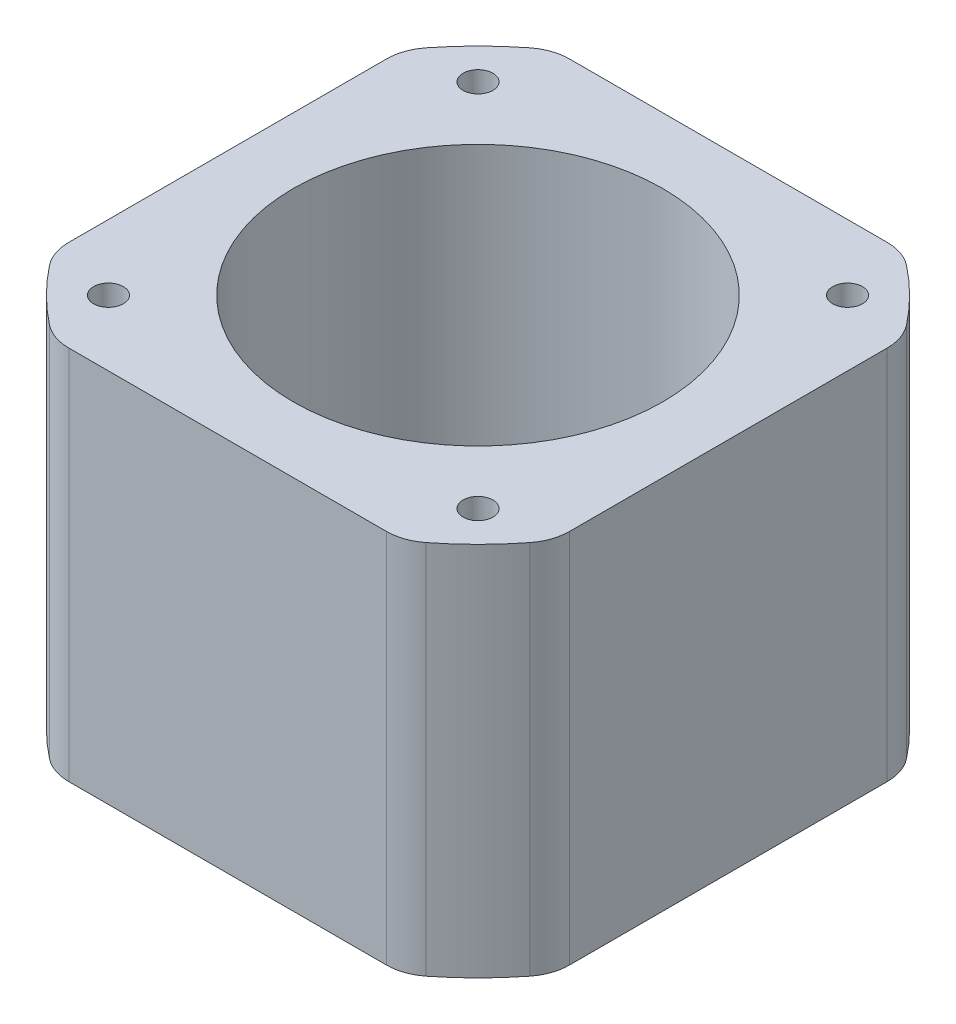
ISO-10303-21;
HEADER;
FILE_DESCRIPTION(('STEP AP214'),'2;1');
FILE_NAME('part.step','',(''),(''),'','','');
FILE_SCHEMA(('AUTOMOTIVE_DESIGN { 1 0 10303 214 1 1 1 1 }'));
ENDSEC;
DATA;
#1=APPLICATION_CONTEXT('core data for automotive mechanical design processes');
#2=APPLICATION_PROTOCOL_DEFINITION('international standard','automotive_design',2000,#1);
#3=PRODUCT_CONTEXT('',#1,'mechanical');
#4=PRODUCT('Part','Part','',(#3));
#5=PRODUCT_RELATED_PRODUCT_CATEGORY('part','',(#4));
#6=PRODUCT_DEFINITION_FORMATION('','',#4);
#7=PRODUCT_DEFINITION_CONTEXT('part definition',#1,'design');
#8=PRODUCT_DEFINITION('design','',#6,#7);
#9=PRODUCT_DEFINITION_SHAPE('','',#8);
#10=(LENGTH_UNIT() NAMED_UNIT(*) SI_UNIT(.MILLI.,.METRE.));
#11=(NAMED_UNIT(*) PLANE_ANGLE_UNIT() SI_UNIT($,.RADIAN.));
#12=(NAMED_UNIT(*) SI_UNIT($,.STERADIAN.) SOLID_ANGLE_UNIT());
#13=UNCERTAINTY_MEASURE_WITH_UNIT(LENGTH_MEASURE(1.E-05),#10,'distance_accuracy_value','');
#14=(GEOMETRIC_REPRESENTATION_CONTEXT(3) GLOBAL_UNCERTAINTY_ASSIGNED_CONTEXT((#13)) GLOBAL_UNIT_ASSIGNED_CONTEXT((#10,
#11,#12)) REPRESENTATION_CONTEXT('',''));
#15=CARTESIAN_POINT('',(0.,0.,0.));
#16=DIRECTION('',(0.,0.,1.));
#17=DIRECTION('',(1.,0.,0.));
#18=AXIS2_PLACEMENT_3D('',#15,#16,#17);
#19=CARTESIAN_POINT('',(0.,31.5,0.));
#20=DIRECTION('',(0.,1.,0.));
#21=DIRECTION('',(0.,0.,1.));
#22=AXIS2_PLACEMENT_3D('',#19,#20,#21);
#23=PLANE('',#22);
#24=CARTESIAN_POINT('',(15.5,31.5,15.5));
#25=DIRECTION('',(0.,1.,0.));
#26=DIRECTION('',(0.,0.,1.));
#27=AXIS2_PLACEMENT_3D('',#24,#25,#26);
#28=CIRCLE('',#27,1.25000000000001);
#29=CARTESIAN_POINT('',(15.5,31.5,16.75));
#30=VERTEX_POINT('',#29);
#31=EDGE_CURVE('E387',#30,#30,#28,.T.);
#32=ORIENTED_EDGE('',*,*,#31,.F.);
#33=EDGE_LOOP('',(#32));
#34=FACE_BOUND('',#33,.T.);
#35=CARTESIAN_POINT('',(-15.5,31.5,-15.5));
#36=DIRECTION('',(0.,1.,0.));
#37=DIRECTION('',(0.,0.,1.));
#38=AXIS2_PLACEMENT_3D('',#35,#36,#37);
#39=CIRCLE('',#38,1.25000000000001);
#40=CARTESIAN_POINT('',(-15.5,31.5,-14.25));
#41=VERTEX_POINT('',#40);
#42=EDGE_CURVE('E372',#41,#41,#39,.T.);
#43=ORIENTED_EDGE('',*,*,#42,.F.);
#44=EDGE_LOOP('',(#43));
#45=FACE_BOUND('',#44,.T.);
#46=CARTESIAN_POINT('',(0.,31.5,0.));
#47=DIRECTION('',(0.,1.,0.));
#48=DIRECTION('',(0.,0.,1.));
#49=AXIS2_PLACEMENT_3D('',#46,#47,#48);
#50=CIRCLE('',#49,25.6);
#51=CARTESIAN_POINT('',(-15.7927871574424,31.5,-20.1481481481482));
#52=VERTEX_POINT('',#51);
#53=CARTESIAN_POINT('',(-20.1481481481481,31.5,-15.7927871574423));
#54=VERTEX_POINT('',#53);
#55=EDGE_CURVE('E354',#52,#54,#50,.T.);
#56=ORIENTED_EDGE('',*,*,#55,.T.);
#57=CARTESIAN_POINT('',(-17.,31.5,-13.325164164092));
#58=DIRECTION('',(0.,1.,0.));
#59=DIRECTION('',(0.,0.,1.));
#60=AXIS2_PLACEMENT_3D('',#57,#58,#59);
#61=CIRCLE('',#60,4.);
#62=CARTESIAN_POINT('',(-21.,31.5,-13.325164164092));
#63=VERTEX_POINT('',#62);
#64=EDGE_CURVE('E264',#54,#63,#61,.T.);
#65=ORIENTED_EDGE('',*,*,#64,.T.);
#66=DIRECTION('',(0.,0.,1.));
#67=VECTOR('',#66,1.);
#68=CARTESIAN_POINT('',(-21.,31.5,14.641038214553));
#69=LINE('',#68,#67);
#70=CARTESIAN_POINT('',(-21.,31.5,13.325164164092));
#71=VERTEX_POINT('',#70);
#72=EDGE_CURVE('E184',#63,#71,#69,.T.);
#73=ORIENTED_EDGE('',*,*,#72,.T.);
#74=CARTESIAN_POINT('',(-17.,31.5,13.325164164092));
#75=DIRECTION('',(0.,1.,0.));
#76=DIRECTION('',(0.,0.,1.));
#77=AXIS2_PLACEMENT_3D('',#74,#75,#76);
#78=CIRCLE('',#77,4.);
#79=CARTESIAN_POINT('',(-20.1481481481481,31.5,15.7927871574423));
#80=VERTEX_POINT('',#79);
#81=EDGE_CURVE('E244',#71,#80,#78,.T.);
#82=ORIENTED_EDGE('',*,*,#81,.T.);
#83=CARTESIAN_POINT('',(0.,31.5,0.));
#84=DIRECTION('',(0.,1.,0.));
#85=DIRECTION('',(0.,0.,1.));
#86=AXIS2_PLACEMENT_3D('',#83,#84,#85);
#87=CIRCLE('',#86,25.6);
#88=CARTESIAN_POINT('',(-15.7927871574423,31.5,20.1481481481481));
#89=VERTEX_POINT('',#88);
#90=EDGE_CURVE('E309',#80,#89,#87,.T.);
#91=ORIENTED_EDGE('',*,*,#90,.T.);
#92=CARTESIAN_POINT('',(-13.325164164092,31.5,17.));
#93=DIRECTION('',(0.,1.,0.));
#94=DIRECTION('',(0.,0.,1.));
#95=AXIS2_PLACEMENT_3D('',#92,#93,#94);
#96=CIRCLE('',#95,4.);
#97=CARTESIAN_POINT('',(-13.325164164092,31.5,21.));
#98=VERTEX_POINT('',#97);
#99=EDGE_CURVE('E247',#89,#98,#96,.T.);
#100=ORIENTED_EDGE('',*,*,#99,.T.);
#101=DIRECTION('',(1.,0.,0.));
#102=VECTOR('',#101,1.);
#103=CARTESIAN_POINT('',(-14.641038214553,31.5,21.));
#104=LINE('',#103,#102);
#105=CARTESIAN_POINT('',(13.325164164092,31.5,21.));
#106=VERTEX_POINT('',#105);
#107=EDGE_CURVE('E322',#98,#106,#104,.T.);
#108=ORIENTED_EDGE('',*,*,#107,.T.);
#109=CARTESIAN_POINT('',(13.3251641640919,31.5,17.));
#110=DIRECTION('',(0.,1.,0.));
#111=DIRECTION('',(0.,0.,1.));
#112=AXIS2_PLACEMENT_3D('',#109,#110,#111);
#113=CIRCLE('',#112,4.);
#114=CARTESIAN_POINT('',(15.7927871574423,31.5,20.1481481481481));
#115=VERTEX_POINT('',#114);
#116=EDGE_CURVE('E250',#106,#115,#113,.T.);
#117=ORIENTED_EDGE('',*,*,#116,.T.);
#118=CARTESIAN_POINT('',(0.,31.5,0.));
#119=DIRECTION('',(0.,1.,0.));
#120=DIRECTION('',(0.,0.,1.));
#121=AXIS2_PLACEMENT_3D('',#118,#119,#120);
#122=CIRCLE('',#121,25.6);
#123=CARTESIAN_POINT('',(20.1481481481481,31.5,15.7927871574423));
#124=VERTEX_POINT('',#123);
#125=EDGE_CURVE('E325',#115,#124,#122,.T.);
#126=ORIENTED_EDGE('',*,*,#125,.T.);
#127=CARTESIAN_POINT('',(17.,31.5,13.3251641640919));
#128=DIRECTION('',(0.,1.,0.));
#129=DIRECTION('',(0.,0.,1.));
#130=AXIS2_PLACEMENT_3D('',#127,#128,#129);
#131=CIRCLE('',#130,4.);
#132=CARTESIAN_POINT('',(21.,31.5,13.3251641640919));
#133=VERTEX_POINT('',#132);
#134=EDGE_CURVE('E71',#124,#133,#131,.T.);
#135=ORIENTED_EDGE('',*,*,#134,.T.);
#136=DIRECTION('',(0.,0.,-1.));
#137=VECTOR('',#136,1.);
#138=CARTESIAN_POINT('',(21.,31.5,14.6410382145529));
#139=LINE('',#138,#137);
#140=CARTESIAN_POINT('',(21.,31.5,-13.325164164092));
#141=VERTEX_POINT('',#140);
#142=EDGE_CURVE('E218',#133,#141,#139,.T.);
#143=ORIENTED_EDGE('',*,*,#142,.T.);
#144=CARTESIAN_POINT('',(17.,31.5,-13.325164164092));
#145=DIRECTION('',(0.,1.,0.));
#146=DIRECTION('',(0.,0.,1.));
#147=AXIS2_PLACEMENT_3D('',#144,#145,#146);
#148=CIRCLE('',#147,4.);
#149=CARTESIAN_POINT('',(20.1481481481482,31.5,-15.7927871574423));
#150=VERTEX_POINT('',#149);
#151=EDGE_CURVE('E255',#141,#150,#148,.T.);
#152=ORIENTED_EDGE('',*,*,#151,.T.);
#153=CARTESIAN_POINT('',(0.,31.5,0.));
#154=DIRECTION('',(0.,1.,0.));
#155=DIRECTION('',(0.,0.,1.));
#156=AXIS2_PLACEMENT_3D('',#153,#154,#155);
#157=CIRCLE('',#156,25.6);
#158=CARTESIAN_POINT('',(15.7927871574423,31.5,-20.1481481481482));
#159=VERTEX_POINT('',#158);
#160=EDGE_CURVE('E216',#150,#159,#157,.T.);
#161=ORIENTED_EDGE('',*,*,#160,.T.);
#162=CARTESIAN_POINT('',(13.325164164092,31.5,-17.));
#163=DIRECTION('',(0.,1.,0.));
#164=DIRECTION('',(0.,0.,1.));
#165=AXIS2_PLACEMENT_3D('',#162,#163,#164);
#166=CIRCLE('',#165,4.);
#167=CARTESIAN_POINT('',(13.325164164092,31.5,-21.));
#168=VERTEX_POINT('',#167);
#169=EDGE_CURVE('E258',#159,#168,#166,.T.);
#170=ORIENTED_EDGE('',*,*,#169,.T.);
#171=DIRECTION('',(-1.,0.,0.));
#172=VECTOR('',#171,1.);
#173=CARTESIAN_POINT('',(-14.641038214553,31.5,-21.));
#174=LINE('',#173,#172);
#175=CARTESIAN_POINT('',(-13.325164164092,31.5,-21.));
#176=VERTEX_POINT('',#175);
#177=EDGE_CURVE('E355',#168,#176,#174,.T.);
#178=ORIENTED_EDGE('',*,*,#177,.T.);
#179=CARTESIAN_POINT('',(-13.325164164092,31.5,-17.));
#180=DIRECTION('',(0.,1.,0.));
#181=DIRECTION('',(0.,0.,1.));
#182=AXIS2_PLACEMENT_3D('',#179,#180,#181);
#183=CIRCLE('',#182,4.);
#184=EDGE_CURVE('E261',#176,#52,#183,.T.);
#185=ORIENTED_EDGE('',*,*,#184,.T.);
#186=EDGE_LOOP('',(#56,#65,#73,#82,#91,#100,#108,#117,#126,#135,#143,#152,#161,#170,#178,#185));
#187=FACE_BOUND('',#186,.T.);
#188=CARTESIAN_POINT('',(0.,31.5,0.));
#189=DIRECTION('',(0.,1.,0.));
#190=DIRECTION('',(0.,0.,1.));
#191=AXIS2_PLACEMENT_3D('',#188,#189,#190);
#192=CIRCLE('',#191,15.5);
#193=CARTESIAN_POINT('',(0.,31.5,15.5));
#194=VERTEX_POINT('',#193);
#195=EDGE_CURVE('E337',#194,#194,#192,.T.);
#196=ORIENTED_EDGE('',*,*,#195,.F.);
#197=EDGE_LOOP('',(#196));
#198=FACE_BOUND('',#197,.T.);
#199=CARTESIAN_POINT('',(15.5,31.5,-15.5));
#200=DIRECTION('',(0.,1.,0.));
#201=DIRECTION('',(0.,0.,1.));
#202=AXIS2_PLACEMENT_3D('',#199,#200,#201);
#203=CIRCLE('',#202,1.25000000000001);
#204=CARTESIAN_POINT('',(15.5,31.5,-14.25));
#205=VERTEX_POINT('',#204);
#206=EDGE_CURVE('E379',#205,#205,#203,.T.);
#207=ORIENTED_EDGE('',*,*,#206,.F.);
#208=EDGE_LOOP('',(#207));
#209=FACE_BOUND('',#208,.T.);
#210=CARTESIAN_POINT('',(-15.5,31.5,15.5));
#211=DIRECTION('',(0.,1.,0.));
#212=DIRECTION('',(0.,0.,1.));
#213=AXIS2_PLACEMENT_3D('',#210,#211,#212);
#214=CIRCLE('',#213,1.25000000000001);
#215=CARTESIAN_POINT('',(-15.5,31.5,16.75));
#216=VERTEX_POINT('',#215);
#217=EDGE_CURVE('E395',#216,#216,#214,.T.);
#218=ORIENTED_EDGE('',*,*,#217,.F.);
#219=EDGE_LOOP('',(#218));
#220=FACE_BOUND('',#219,.T.);
#221=ADVANCED_FACE('F48',(#34,#45,#187,#198,#209,#220),#23,.T.);
#222=CARTESIAN_POINT('',(0.,0.,0.));
#223=DIRECTION('',(0.,1.,0.));
#224=DIRECTION('',(0.,0.,1.));
#225=AXIS2_PLACEMENT_3D('',#222,#223,#224);
#226=PLANE('',#225);
#227=CARTESIAN_POINT('',(15.5,0.,15.5));
#228=DIRECTION('',(0.,1.,0.));
#229=DIRECTION('',(0.,0.,1.));
#230=AXIS2_PLACEMENT_3D('',#227,#228,#229);
#231=CIRCLE('',#230,1.25000000000001);
#232=CARTESIAN_POINT('',(15.5,0.,16.75));
#233=VERTEX_POINT('',#232);
#234=EDGE_CURVE('E391',#233,#233,#231,.T.);
#235=ORIENTED_EDGE('',*,*,#234,.T.);
#236=EDGE_LOOP('',(#235));
#237=FACE_BOUND('',#236,.T.);
#238=CARTESIAN_POINT('',(-15.5,0.,-15.5));
#239=DIRECTION('',(0.,1.,0.));
#240=DIRECTION('',(0.,0.,1.));
#241=AXIS2_PLACEMENT_3D('',#238,#239,#240);
#242=CIRCLE('',#241,1.25000000000001);
#243=CARTESIAN_POINT('',(-15.5,0.,-14.25));
#244=VERTEX_POINT('',#243);
#245=EDGE_CURVE('E376',#244,#244,#242,.T.);
#246=ORIENTED_EDGE('',*,*,#245,.T.);
#247=EDGE_LOOP('',(#246));
#248=FACE_BOUND('',#247,.T.);
#249=DIRECTION('',(0.,0.,1.));
#250=VECTOR('',#249,1.);
#251=CARTESIAN_POINT('',(-21.,0.,14.641038214553));
#252=LINE('',#251,#250);
#253=CARTESIAN_POINT('',(-21.,0.,-13.325164164092));
#254=VERTEX_POINT('',#253);
#255=CARTESIAN_POINT('',(-21.,0.,13.325164164092));
#256=VERTEX_POINT('',#255);
#257=EDGE_CURVE('E181',#254,#256,#252,.T.);
#258=ORIENTED_EDGE('',*,*,#257,.F.);
#259=CARTESIAN_POINT('',(-17.,0.,-13.325164164092));
#260=DIRECTION('',(0.,1.,0.));
#261=DIRECTION('',(0.,0.,1.));
#262=AXIS2_PLACEMENT_3D('',#259,#260,#261);
#263=CIRCLE('',#262,4.);
#264=CARTESIAN_POINT('',(-20.1481481481481,0.,-15.7927871574423));
#265=VERTEX_POINT('',#264);
#266=EDGE_CURVE('E163',#254,#265,#263,.F.);
#267=ORIENTED_EDGE('',*,*,#266,.T.);
#268=CARTESIAN_POINT('',(0.,0.,0.));
#269=DIRECTION('',(0.,1.,0.));
#270=DIRECTION('',(0.,0.,1.));
#271=AXIS2_PLACEMENT_3D('',#268,#269,#270);
#272=CIRCLE('',#271,25.6);
#273=CARTESIAN_POINT('',(-15.7927871574424,0.,-20.1481481481482));
#274=VERTEX_POINT('',#273);
#275=EDGE_CURVE('E194',#274,#265,#272,.T.);
#276=ORIENTED_EDGE('',*,*,#275,.F.);
#277=CARTESIAN_POINT('',(-13.325164164092,0.,-17.));
#278=DIRECTION('',(0.,1.,0.));
#279=DIRECTION('',(0.,0.,1.));
#280=AXIS2_PLACEMENT_3D('',#277,#278,#279);
#281=CIRCLE('',#280,4.);
#282=CARTESIAN_POINT('',(-13.325164164092,0.,-21.));
#283=VERTEX_POINT('',#282);
#284=EDGE_CURVE('E175',#274,#283,#281,.F.);
#285=ORIENTED_EDGE('',*,*,#284,.T.);
#286=DIRECTION('',(-1.,0.,0.));
#287=VECTOR('',#286,1.);
#288=CARTESIAN_POINT('',(-14.641038214553,0.,-21.));
#289=LINE('',#288,#287);
#290=CARTESIAN_POINT('',(13.325164164092,0.,-21.));
#291=VERTEX_POINT('',#290);
#292=EDGE_CURVE('E202',#291,#283,#289,.T.);
#293=ORIENTED_EDGE('',*,*,#292,.F.);
#294=CARTESIAN_POINT('',(13.325164164092,0.,-17.));
#295=DIRECTION('',(0.,1.,0.));
#296=DIRECTION('',(0.,0.,1.));
#297=AXIS2_PLACEMENT_3D('',#294,#295,#296);
#298=CIRCLE('',#297,4.);
#299=CARTESIAN_POINT('',(15.7927871574423,0.,-20.1481481481482));
#300=VERTEX_POINT('',#299);
#301=EDGE_CURVE('E234',#291,#300,#298,.F.);
#302=ORIENTED_EDGE('',*,*,#301,.T.);
#303=CARTESIAN_POINT('',(0.,0.,0.));
#304=DIRECTION('',(0.,1.,0.));
#305=DIRECTION('',(0.,0.,1.));
#306=AXIS2_PLACEMENT_3D('',#303,#304,#305);
#307=CIRCLE('',#306,25.6);
#308=CARTESIAN_POINT('',(20.1481481481482,0.,-15.7927871574423));
#309=VERTEX_POINT('',#308);
#310=EDGE_CURVE('E334',#309,#300,#307,.T.);
#311=ORIENTED_EDGE('',*,*,#310,.F.);
#312=CARTESIAN_POINT('',(17.,0.,-13.325164164092));
#313=DIRECTION('',(0.,1.,0.));
#314=DIRECTION('',(0.,0.,1.));
#315=AXIS2_PLACEMENT_3D('',#312,#313,#314);
#316=CIRCLE('',#315,4.);
#317=CARTESIAN_POINT('',(21.,0.,-13.325164164092));
#318=VERTEX_POINT('',#317);
#319=EDGE_CURVE('E231',#309,#318,#316,.F.);
#320=ORIENTED_EDGE('',*,*,#319,.T.);
#321=DIRECTION('',(0.,0.,-1.));
#322=VECTOR('',#321,1.);
#323=CARTESIAN_POINT('',(21.,0.,14.6410382145529));
#324=LINE('',#323,#322);
#325=CARTESIAN_POINT('',(21.,0.,13.3251641640919));
#326=VERTEX_POINT('',#325);
#327=EDGE_CURVE('E213',#326,#318,#324,.T.);
#328=ORIENTED_EDGE('',*,*,#327,.F.);
#329=CARTESIAN_POINT('',(17.,0.,13.3251641640919));
#330=DIRECTION('',(0.,1.,0.));
#331=DIRECTION('',(0.,0.,1.));
#332=AXIS2_PLACEMENT_3D('',#329,#330,#331);
#333=CIRCLE('',#332,4.);
#334=CARTESIAN_POINT('',(20.1481481481481,0.,15.7927871574423));
#335=VERTEX_POINT('',#334);
#336=EDGE_CURVE('E228',#326,#335,#333,.F.);
#337=ORIENTED_EDGE('',*,*,#336,.T.);
#338=CARTESIAN_POINT('',(0.,0.,0.));
#339=DIRECTION('',(0.,1.,0.));
#340=DIRECTION('',(0.,0.,1.));
#341=AXIS2_PLACEMENT_3D('',#338,#339,#340);
#342=CIRCLE('',#341,25.6);
#343=CARTESIAN_POINT('',(15.7927871574423,0.,20.1481481481481));
#344=VERTEX_POINT('',#343);
#345=EDGE_CURVE('E209',#344,#335,#342,.T.);
#346=ORIENTED_EDGE('',*,*,#345,.F.);
#347=CARTESIAN_POINT('',(13.3251641640919,0.,17.));
#348=DIRECTION('',(0.,1.,0.));
#349=DIRECTION('',(0.,0.,1.));
#350=AXIS2_PLACEMENT_3D('',#347,#348,#349);
#351=CIRCLE('',#350,4.);
#352=CARTESIAN_POINT('',(13.325164164092,0.,21.));
#353=VERTEX_POINT('',#352);
#354=EDGE_CURVE('E225',#344,#353,#351,.F.);
#355=ORIENTED_EDGE('',*,*,#354,.T.);
#356=DIRECTION('',(1.,0.,0.));
#357=VECTOR('',#356,1.);
#358=CARTESIAN_POINT('',(-14.641038214553,0.,21.));
#359=LINE('',#358,#357);
#360=CARTESIAN_POINT('',(-13.325164164092,0.,21.));
#361=VERTEX_POINT('',#360);
#362=EDGE_CURVE('E199',#361,#353,#359,.T.);
#363=ORIENTED_EDGE('',*,*,#362,.F.);
#364=CARTESIAN_POINT('',(-13.325164164092,0.,17.));
#365=DIRECTION('',(0.,1.,0.));
#366=DIRECTION('',(0.,0.,1.));
#367=AXIS2_PLACEMENT_3D('',#364,#365,#366);
#368=CIRCLE('',#367,4.);
#369=CARTESIAN_POINT('',(-15.7927871574423,0.,20.1481481481481));
#370=VERTEX_POINT('',#369);
#371=EDGE_CURVE('E222',#361,#370,#368,.F.);
#372=ORIENTED_EDGE('',*,*,#371,.T.);
#373=CARTESIAN_POINT('',(0.,0.,0.));
#374=DIRECTION('',(0.,1.,0.));
#375=DIRECTION('',(0.,0.,1.));
#376=AXIS2_PLACEMENT_3D('',#373,#374,#375);
#377=CIRCLE('',#376,25.6);
#378=CARTESIAN_POINT('',(-20.1481481481481,0.,15.7927871574423));
#379=VERTEX_POINT('',#378);
#380=EDGE_CURVE('E193',#379,#370,#377,.T.);
#381=ORIENTED_EDGE('',*,*,#380,.F.);
#382=CARTESIAN_POINT('',(-17.,0.,13.325164164092));
#383=DIRECTION('',(0.,1.,0.));
#384=DIRECTION('',(0.,0.,1.));
#385=AXIS2_PLACEMENT_3D('',#382,#383,#384);
#386=CIRCLE('',#385,4.);
#387=EDGE_CURVE('E186',#379,#256,#386,.F.);
#388=ORIENTED_EDGE('',*,*,#387,.T.);
#389=EDGE_LOOP('',(#258,#267,#276,#285,#293,#302,#311,#320,#328,#337,#346,#355,#363,#372,#381,#388));
#390=FACE_BOUND('',#389,.T.);
#391=CARTESIAN_POINT('',(0.,0.,0.));
#392=DIRECTION('',(0.,1.,0.));
#393=DIRECTION('',(0.,0.,1.));
#394=AXIS2_PLACEMENT_3D('',#391,#392,#393);
#395=CIRCLE('',#394,15.5);
#396=CARTESIAN_POINT('',(0.,0.,15.5));
#397=VERTEX_POINT('',#396);
#398=EDGE_CURVE('E368',#397,#397,#395,.T.);
#399=ORIENTED_EDGE('',*,*,#398,.T.);
#400=EDGE_LOOP('',(#399));
#401=FACE_BOUND('',#400,.T.);
#402=CARTESIAN_POINT('',(15.5,0.,-15.5));
#403=DIRECTION('',(0.,1.,0.));
#404=DIRECTION('',(0.,0.,1.));
#405=AXIS2_PLACEMENT_3D('',#402,#403,#404);
#406=CIRCLE('',#405,1.25000000000001);
#407=CARTESIAN_POINT('',(15.5,0.,-14.25));
#408=VERTEX_POINT('',#407);
#409=EDGE_CURVE('E383',#408,#408,#406,.T.);
#410=ORIENTED_EDGE('',*,*,#409,.T.);
#411=EDGE_LOOP('',(#410));
#412=FACE_BOUND('',#411,.T.);
#413=CARTESIAN_POINT('',(-15.5,0.,15.5));
#414=DIRECTION('',(0.,1.,0.));
#415=DIRECTION('',(0.,0.,1.));
#416=AXIS2_PLACEMENT_3D('',#413,#414,#415);
#417=CIRCLE('',#416,1.25000000000001);
#418=CARTESIAN_POINT('',(-15.5,0.,16.75));
#419=VERTEX_POINT('',#418);
#420=EDGE_CURVE('E398',#419,#419,#417,.T.);
#421=ORIENTED_EDGE('',*,*,#420,.T.);
#422=EDGE_LOOP('',(#421));
#423=FACE_BOUND('',#422,.T.);
#424=ADVANCED_FACE('F189',(#237,#248,#390,#401,#412,#423),#226,.F.);
#425=CARTESIAN_POINT('',(0.,31.5,0.));
#426=DIRECTION('',(0.,-1.,0.));
#427=DIRECTION('',(0.,0.,-1.));
#428=AXIS2_PLACEMENT_3D('',#425,#426,#427);
#429=CYLINDRICAL_SURFACE('',#428,25.6);
#430=ORIENTED_EDGE('',*,*,#310,.T.);
#431=DIRECTION('',(0.,-1.,0.));
#432=VECTOR('',#431,1.);
#433=CARTESIAN_POINT('',(15.7927871574423,31.5,-20.1481481481482));
#434=LINE('',#433,#432);
#435=EDGE_CURVE('E278',#300,#159,#434,.F.);
#436=ORIENTED_EDGE('',*,*,#435,.T.);
#437=ORIENTED_EDGE('',*,*,#160,.F.);
#438=DIRECTION('',(0.,-1.,0.));
#439=VECTOR('',#438,1.);
#440=CARTESIAN_POINT('',(20.1481481481482,31.5,-15.7927871574423));
#441=LINE('',#440,#439);
#442=EDGE_CURVE('E274',#150,#309,#441,.T.);
#443=ORIENTED_EDGE('',*,*,#442,.T.);
#444=EDGE_LOOP('',(#430,#436,#437,#443));
#445=FACE_BOUND('',#444,.T.);
#446=ADVANCED_FACE('F415',(#445),#429,.T.);
#447=CARTESIAN_POINT('',(-14.641038214553,31.5,-21.));
#448=DIRECTION('',(0.,0.,1.));
#449=DIRECTION('',(1.,0.,0.));
#450=AXIS2_PLACEMENT_3D('',#447,#448,#449);
#451=PLANE('',#450);
#452=ORIENTED_EDGE('',*,*,#292,.T.);
#453=DIRECTION('',(0.,-1.,0.));
#454=VECTOR('',#453,1.);
#455=CARTESIAN_POINT('',(-13.325164164092,31.5,-21.));
#456=LINE('',#455,#454);
#457=EDGE_CURVE('E271',#283,#176,#456,.F.);
#458=ORIENTED_EDGE('',*,*,#457,.T.);
#459=ORIENTED_EDGE('',*,*,#177,.F.);
#460=DIRECTION('',(0.,-1.,0.));
#461=VECTOR('',#460,1.);
#462=CARTESIAN_POINT('',(13.325164164092,31.5,-21.));
#463=LINE('',#462,#461);
#464=EDGE_CURVE('E267',#168,#291,#463,.T.);
#465=ORIENTED_EDGE('',*,*,#464,.T.);
#466=EDGE_LOOP('',(#452,#458,#459,#465));
#467=FACE_BOUND('',#466,.T.);
#468=ADVANCED_FACE('F343',(#467),#451,.F.);
#469=CARTESIAN_POINT('',(0.,31.5,0.));
#470=DIRECTION('',(0.,-1.,0.));
#471=DIRECTION('',(0.,0.,-1.));
#472=AXIS2_PLACEMENT_3D('',#469,#470,#471);
#473=CYLINDRICAL_SURFACE('',#472,25.6);
#474=ORIENTED_EDGE('',*,*,#275,.T.);
#475=DIRECTION('',(0.,-1.,0.));
#476=VECTOR('',#475,1.);
#477=CARTESIAN_POINT('',(-20.1481481481481,31.5,-15.7927871574423));
#478=LINE('',#477,#476);
#479=EDGE_CURVE('E168',#265,#54,#478,.F.);
#480=ORIENTED_EDGE('',*,*,#479,.T.);
#481=ORIENTED_EDGE('',*,*,#55,.F.);
#482=DIRECTION('',(0.,-1.,0.));
#483=VECTOR('',#482,1.);
#484=CARTESIAN_POINT('',(-15.7927871574424,31.5,-20.1481481481482));
#485=LINE('',#484,#483);
#486=EDGE_CURVE('E174',#52,#274,#485,.T.);
#487=ORIENTED_EDGE('',*,*,#486,.T.);
#488=EDGE_LOOP('',(#474,#480,#481,#487));
#489=FACE_BOUND('',#488,.T.);
#490=ADVANCED_FACE('F357',(#489),#473,.T.);
#491=CARTESIAN_POINT('',(-21.,31.5,14.641038214553));
#492=DIRECTION('',(1.,0.,0.));
#493=DIRECTION('',(0.,0.,-1.));
#494=AXIS2_PLACEMENT_3D('',#491,#492,#493);
#495=PLANE('',#494);
#496=ORIENTED_EDGE('',*,*,#72,.F.);
#497=DIRECTION('',(0.,-1.,0.));
#498=VECTOR('',#497,1.);
#499=CARTESIAN_POINT('',(-21.,31.5,-13.325164164092));
#500=LINE('',#499,#498);
#501=EDGE_CURVE('E167',#63,#254,#500,.T.);
#502=ORIENTED_EDGE('',*,*,#501,.T.);
#503=ORIENTED_EDGE('',*,*,#257,.T.);
#504=DIRECTION('',(0.,-1.,0.));
#505=VECTOR('',#504,1.);
#506=CARTESIAN_POINT('',(-21.,31.5,13.325164164092));
#507=LINE('',#506,#505);
#508=EDGE_CURVE('E187',#256,#71,#507,.F.);
#509=ORIENTED_EDGE('',*,*,#508,.T.);
#510=EDGE_LOOP('',(#496,#502,#503,#509));
#511=FACE_BOUND('',#510,.T.);
#512=ADVANCED_FACE('F180',(#511),#495,.F.);
#513=CARTESIAN_POINT('',(0.,31.5,0.));
#514=DIRECTION('',(0.,-1.,0.));
#515=DIRECTION('',(0.,0.,-1.));
#516=AXIS2_PLACEMENT_3D('',#513,#514,#515);
#517=CYLINDRICAL_SURFACE('',#516,25.6);
#518=ORIENTED_EDGE('',*,*,#380,.T.);
#519=DIRECTION('',(0.,-1.,0.));
#520=VECTOR('',#519,1.);
#521=CARTESIAN_POINT('',(-15.7927871574423,31.5,20.1481481481481));
#522=LINE('',#521,#520);
#523=EDGE_CURVE('E13',#370,#89,#522,.F.);
#524=ORIENTED_EDGE('',*,*,#523,.T.);
#525=ORIENTED_EDGE('',*,*,#90,.F.);
#526=DIRECTION('',(0.,-1.,0.));
#527=VECTOR('',#526,1.);
#528=CARTESIAN_POINT('',(-20.1481481481481,31.5,15.7927871574423));
#529=LINE('',#528,#527);
#530=EDGE_CURVE('E57',#80,#379,#529,.T.);
#531=ORIENTED_EDGE('',*,*,#530,.T.);
#532=EDGE_LOOP('',(#518,#524,#525,#531));
#533=FACE_BOUND('',#532,.T.);
#534=ADVANCED_FACE('F306',(#533),#517,.T.);
#535=CARTESIAN_POINT('',(-14.641038214553,31.5,21.));
#536=DIRECTION('',(0.,0.,-1.));
#537=DIRECTION('',(-1.,0.,0.));
#538=AXIS2_PLACEMENT_3D('',#535,#536,#537);
#539=PLANE('',#538);
#540=ORIENTED_EDGE('',*,*,#362,.T.);
#541=DIRECTION('',(0.,-1.,0.));
#542=VECTOR('',#541,1.);
#543=CARTESIAN_POINT('',(13.325164164092,31.5,21.));
#544=LINE('',#543,#542);
#545=EDGE_CURVE('E298',#353,#106,#544,.F.);
#546=ORIENTED_EDGE('',*,*,#545,.T.);
#547=ORIENTED_EDGE('',*,*,#107,.F.);
#548=DIRECTION('',(0.,-1.,0.));
#549=VECTOR('',#548,1.);
#550=CARTESIAN_POINT('',(-13.325164164092,31.5,21.));
#551=LINE('',#550,#549);
#552=EDGE_CURVE('E294',#98,#361,#551,.T.);
#553=ORIENTED_EDGE('',*,*,#552,.T.);
#554=EDGE_LOOP('',(#540,#546,#547,#553));
#555=FACE_BOUND('',#554,.T.);
#556=ADVANCED_FACE('F319',(#555),#539,.F.);
#557=CARTESIAN_POINT('',(0.,31.5,0.));
#558=DIRECTION('',(0.,-1.,0.));
#559=DIRECTION('',(0.,0.,-1.));
#560=AXIS2_PLACEMENT_3D('',#557,#558,#559);
#561=CYLINDRICAL_SURFACE('',#560,25.6);
#562=ORIENTED_EDGE('',*,*,#345,.T.);
#563=DIRECTION('',(0.,-1.,0.));
#564=VECTOR('',#563,1.);
#565=CARTESIAN_POINT('',(20.1481481481481,31.5,15.7927871574423));
#566=LINE('',#565,#564);
#567=EDGE_CURVE('E291',#335,#124,#566,.F.);
#568=ORIENTED_EDGE('',*,*,#567,.T.);
#569=ORIENTED_EDGE('',*,*,#125,.F.);
#570=DIRECTION('',(0.,-1.,0.));
#571=VECTOR('',#570,1.);
#572=CARTESIAN_POINT('',(15.7927871574423,31.5,20.1481481481481));
#573=LINE('',#572,#571);
#574=EDGE_CURVE('E287',#115,#344,#573,.T.);
#575=ORIENTED_EDGE('',*,*,#574,.T.);
#576=EDGE_LOOP('',(#562,#568,#569,#575));
#577=FACE_BOUND('',#576,.T.);
#578=ADVANCED_FACE('F427',(#577),#561,.T.);
#579=CARTESIAN_POINT('',(21.,31.5,14.6410382145529));
#580=DIRECTION('',(-1.,0.,0.));
#581=DIRECTION('',(0.,0.,1.));
#582=AXIS2_PLACEMENT_3D('',#579,#580,#581);
#583=PLANE('',#582);
#584=ORIENTED_EDGE('',*,*,#327,.T.);
#585=DIRECTION('',(0.,-1.,0.));
#586=VECTOR('',#585,1.);
#587=CARTESIAN_POINT('',(21.,31.5,-13.325164164092));
#588=LINE('',#587,#586);
#589=EDGE_CURVE('E64',#318,#141,#588,.F.);
#590=ORIENTED_EDGE('',*,*,#589,.T.);
#591=ORIENTED_EDGE('',*,*,#142,.F.);
#592=DIRECTION('',(0.,-1.,0.));
#593=VECTOR('',#592,1.);
#594=CARTESIAN_POINT('',(21.,31.5,13.3251641640919));
#595=LINE('',#594,#593);
#596=EDGE_CURVE('E281',#133,#326,#595,.T.);
#597=ORIENTED_EDGE('',*,*,#596,.T.);
#598=EDGE_LOOP('',(#584,#590,#591,#597));
#599=FACE_BOUND('',#598,.T.);
#600=ADVANCED_FACE('F424',(#599),#583,.F.);
#601=CARTESIAN_POINT('',(0.,31.5,0.));
#602=DIRECTION('',(0.,-1.,0.));
#603=DIRECTION('',(0.,0.,-1.));
#604=AXIS2_PLACEMENT_3D('',#601,#602,#603);
#605=CYLINDRICAL_SURFACE('',#604,15.5);
#606=ORIENTED_EDGE('',*,*,#195,.T.);
#607=EDGE_LOOP('',(#606));
#608=FACE_BOUND('',#607,.T.);
#609=ORIENTED_EDGE('',*,*,#398,.F.);
#610=EDGE_LOOP('',(#609));
#611=FACE_BOUND('',#610,.T.);
#612=ADVANCED_FACE('F421',(#608,#611),#605,.F.);
#613=CARTESIAN_POINT('',(-15.5,31.5,-15.5));
#614=DIRECTION('',(0.,-1.,0.));
#615=DIRECTION('',(0.,0.,-1.));
#616=AXIS2_PLACEMENT_3D('',#613,#614,#615);
#617=CYLINDRICAL_SURFACE('',#616,1.25000000000001);
#618=ORIENTED_EDGE('',*,*,#42,.T.);
#619=EDGE_LOOP('',(#618));
#620=FACE_BOUND('',#619,.T.);
#621=ORIENTED_EDGE('',*,*,#245,.F.);
#622=EDGE_LOOP('',(#621));
#623=FACE_BOUND('',#622,.T.);
#624=ADVANCED_FACE('F517',(#620,#623),#617,.F.);
#625=CARTESIAN_POINT('',(15.5,31.5,-15.5));
#626=DIRECTION('',(0.,-1.,0.));
#627=DIRECTION('',(0.,0.,-1.));
#628=AXIS2_PLACEMENT_3D('',#625,#626,#627);
#629=CYLINDRICAL_SURFACE('',#628,1.25000000000001);
#630=ORIENTED_EDGE('',*,*,#206,.T.);
#631=EDGE_LOOP('',(#630));
#632=FACE_BOUND('',#631,.T.);
#633=ORIENTED_EDGE('',*,*,#409,.F.);
#634=EDGE_LOOP('',(#633));
#635=FACE_BOUND('',#634,.T.);
#636=ADVANCED_FACE('F509',(#632,#635),#629,.F.);
#637=CARTESIAN_POINT('',(15.5,31.5,15.5));
#638=DIRECTION('',(0.,-1.,0.));
#639=DIRECTION('',(0.,0.,-1.));
#640=AXIS2_PLACEMENT_3D('',#637,#638,#639);
#641=CYLINDRICAL_SURFACE('',#640,1.25000000000001);
#642=ORIENTED_EDGE('',*,*,#31,.T.);
#643=EDGE_LOOP('',(#642));
#644=FACE_BOUND('',#643,.T.);
#645=ORIENTED_EDGE('',*,*,#234,.F.);
#646=EDGE_LOOP('',(#645));
#647=FACE_BOUND('',#646,.T.);
#648=ADVANCED_FACE('F502',(#644,#647),#641,.F.);
#649=CARTESIAN_POINT('',(-15.5,31.5,15.5));
#650=DIRECTION('',(0.,-1.,0.));
#651=DIRECTION('',(0.,0.,-1.));
#652=AXIS2_PLACEMENT_3D('',#649,#650,#651);
#653=CYLINDRICAL_SURFACE('',#652,1.25000000000001);
#654=ORIENTED_EDGE('',*,*,#217,.T.);
#655=EDGE_LOOP('',(#654));
#656=FACE_BOUND('',#655,.T.);
#657=ORIENTED_EDGE('',*,*,#420,.F.);
#658=EDGE_LOOP('',(#657));
#659=FACE_BOUND('',#658,.T.);
#660=ADVANCED_FACE('F406',(#656,#659),#653,.F.);
#661=CARTESIAN_POINT('',(-17.,31.5,-13.325164164092));
#662=DIRECTION('',(0.,-1.,0.));
#663=DIRECTION('',(0.,0.,-1.));
#664=AXIS2_PLACEMENT_3D('',#661,#662,#663);
#665=CYLINDRICAL_SURFACE('',#664,4.);
#666=ORIENTED_EDGE('',*,*,#64,.F.);
#667=ORIENTED_EDGE('',*,*,#479,.F.);
#668=ORIENTED_EDGE('',*,*,#266,.F.);
#669=ORIENTED_EDGE('',*,*,#501,.F.);
#670=EDGE_LOOP('',(#666,#667,#668,#669));
#671=FACE_BOUND('',#670,.T.);
#672=ADVANCED_FACE('F166',(#671),#665,.T.);
#673=CARTESIAN_POINT('',(-13.325164164092,31.5,-17.));
#674=DIRECTION('',(0.,-1.,0.));
#675=DIRECTION('',(0.,0.,-1.));
#676=AXIS2_PLACEMENT_3D('',#673,#674,#675);
#677=CYLINDRICAL_SURFACE('',#676,4.);
#678=ORIENTED_EDGE('',*,*,#184,.F.);
#679=ORIENTED_EDGE('',*,*,#457,.F.);
#680=ORIENTED_EDGE('',*,*,#284,.F.);
#681=ORIENTED_EDGE('',*,*,#486,.F.);
#682=EDGE_LOOP('',(#678,#679,#680,#681));
#683=FACE_BOUND('',#682,.T.);
#684=ADVANCED_FACE('F349',(#683),#677,.T.);
#685=CARTESIAN_POINT('',(13.325164164092,31.5,-17.));
#686=DIRECTION('',(0.,-1.,0.));
#687=DIRECTION('',(0.,0.,-1.));
#688=AXIS2_PLACEMENT_3D('',#685,#686,#687);
#689=CYLINDRICAL_SURFACE('',#688,4.);
#690=ORIENTED_EDGE('',*,*,#169,.F.);
#691=ORIENTED_EDGE('',*,*,#435,.F.);
#692=ORIENTED_EDGE('',*,*,#301,.F.);
#693=ORIENTED_EDGE('',*,*,#464,.F.);
#694=EDGE_LOOP('',(#690,#691,#692,#693));
#695=FACE_BOUND('',#694,.T.);
#696=ADVANCED_FACE('F448',(#695),#689,.T.);
#697=CARTESIAN_POINT('',(17.,31.5,-13.325164164092));
#698=DIRECTION('',(0.,-1.,0.));
#699=DIRECTION('',(0.,0.,-1.));
#700=AXIS2_PLACEMENT_3D('',#697,#698,#699);
#701=CYLINDRICAL_SURFACE('',#700,4.);
#702=ORIENTED_EDGE('',*,*,#151,.F.);
#703=ORIENTED_EDGE('',*,*,#589,.F.);
#704=ORIENTED_EDGE('',*,*,#319,.F.);
#705=ORIENTED_EDGE('',*,*,#442,.F.);
#706=EDGE_LOOP('',(#702,#703,#704,#705));
#707=FACE_BOUND('',#706,.T.);
#708=ADVANCED_FACE('F451',(#707),#701,.T.);
#709=CARTESIAN_POINT('',(17.,31.5,13.3251641640919));
#710=DIRECTION('',(0.,-1.,0.));
#711=DIRECTION('',(0.,0.,-1.));
#712=AXIS2_PLACEMENT_3D('',#709,#710,#711);
#713=CYLINDRICAL_SURFACE('',#712,4.);
#714=ORIENTED_EDGE('',*,*,#134,.F.);
#715=ORIENTED_EDGE('',*,*,#567,.F.);
#716=ORIENTED_EDGE('',*,*,#336,.F.);
#717=ORIENTED_EDGE('',*,*,#596,.F.);
#718=EDGE_LOOP('',(#714,#715,#716,#717));
#719=FACE_BOUND('',#718,.T.);
#720=ADVANCED_FACE('F455',(#719),#713,.T.);
#721=CARTESIAN_POINT('',(13.3251641640919,31.5,17.));
#722=DIRECTION('',(0.,-1.,0.));
#723=DIRECTION('',(0.,0.,-1.));
#724=AXIS2_PLACEMENT_3D('',#721,#722,#723);
#725=CYLINDRICAL_SURFACE('',#724,4.);
#726=ORIENTED_EDGE('',*,*,#116,.F.);
#727=ORIENTED_EDGE('',*,*,#545,.F.);
#728=ORIENTED_EDGE('',*,*,#354,.F.);
#729=ORIENTED_EDGE('',*,*,#574,.F.);
#730=EDGE_LOOP('',(#726,#727,#728,#729));
#731=FACE_BOUND('',#730,.T.);
#732=ADVANCED_FACE('F459',(#731),#725,.T.);
#733=CARTESIAN_POINT('',(-13.325164164092,31.5,17.));
#734=DIRECTION('',(0.,-1.,0.));
#735=DIRECTION('',(0.,0.,-1.));
#736=AXIS2_PLACEMENT_3D('',#733,#734,#735);
#737=CYLINDRICAL_SURFACE('',#736,4.);
#738=ORIENTED_EDGE('',*,*,#99,.F.);
#739=ORIENTED_EDGE('',*,*,#523,.F.);
#740=ORIENTED_EDGE('',*,*,#371,.F.);
#741=ORIENTED_EDGE('',*,*,#552,.F.);
#742=EDGE_LOOP('',(#738,#739,#740,#741));
#743=FACE_BOUND('',#742,.T.);
#744=ADVANCED_FACE('F316',(#743),#737,.T.);
#745=CARTESIAN_POINT('',(-17.,31.5,13.325164164092));
#746=DIRECTION('',(0.,-1.,0.));
#747=DIRECTION('',(0.,0.,-1.));
#748=AXIS2_PLACEMENT_3D('',#745,#746,#747);
#749=CYLINDRICAL_SURFACE('',#748,4.);
#750=ORIENTED_EDGE('',*,*,#81,.F.);
#751=ORIENTED_EDGE('',*,*,#508,.F.);
#752=ORIENTED_EDGE('',*,*,#387,.F.);
#753=ORIENTED_EDGE('',*,*,#530,.F.);
#754=EDGE_LOOP('',(#750,#751,#752,#753));
#755=FACE_BOUND('',#754,.T.);
#756=ADVANCED_FACE('F50',(#755),#749,.T.);
#757=CLOSED_SHELL('',(#221,#424,#446,#468,#490,#512,#534,#556,#578,#600,#612,#624,#636,#648,
#660,#672,#684,#696,#708,#720,#732,#744,#756));
#758=MANIFOLD_SOLID_BREP('B2',#757);
#759=ADVANCED_BREP_SHAPE_REPRESENTATION('',(#18,#758),#14);
#760=SHAPE_DEFINITION_REPRESENTATION(#9,#759);
ENDSEC;
END-ISO-10303-21;
